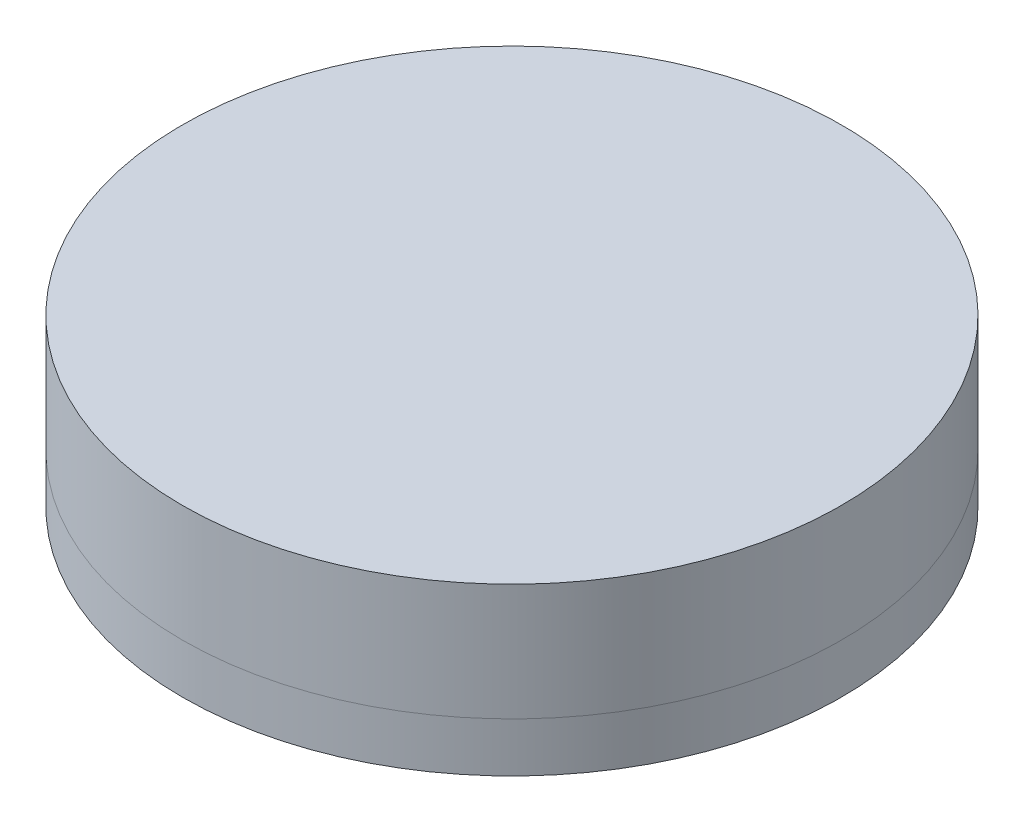
ISO-10303-21;
HEADER;
FILE_DESCRIPTION(('STEP AP214'),'2;1');
FILE_NAME('part.step','',(''),(''),'','','');
FILE_SCHEMA(('AUTOMOTIVE_DESIGN { 1 0 10303 214 1 1 1 1 }'));
ENDSEC;
DATA;
#1=APPLICATION_CONTEXT('core data for automotive mechanical design processes');
#2=APPLICATION_PROTOCOL_DEFINITION('international standard','automotive_design',2000,#1);
#3=PRODUCT_CONTEXT('',#1,'mechanical');
#4=PRODUCT('Part','Part','',(#3));
#5=PRODUCT_RELATED_PRODUCT_CATEGORY('part','',(#4));
#6=PRODUCT_DEFINITION_FORMATION('','',#4);
#7=PRODUCT_DEFINITION_CONTEXT('part definition',#1,'design');
#8=PRODUCT_DEFINITION('design','',#6,#7);
#9=PRODUCT_DEFINITION_SHAPE('','',#8);
#10=(LENGTH_UNIT() NAMED_UNIT(*) SI_UNIT(.MILLI.,.METRE.));
#11=(NAMED_UNIT(*) PLANE_ANGLE_UNIT() SI_UNIT($,.RADIAN.));
#12=(NAMED_UNIT(*) SI_UNIT($,.STERADIAN.) SOLID_ANGLE_UNIT());
#13=UNCERTAINTY_MEASURE_WITH_UNIT(LENGTH_MEASURE(1.E-05),#10,'distance_accuracy_value','');
#14=(GEOMETRIC_REPRESENTATION_CONTEXT(3) GLOBAL_UNCERTAINTY_ASSIGNED_CONTEXT((#13)) GLOBAL_UNIT_ASSIGNED_CONTEXT((#10,
#11,#12)) REPRESENTATION_CONTEXT('',''));
#15=CARTESIAN_POINT('',(0.,0.,0.));
#16=DIRECTION('',(0.,0.,1.));
#17=DIRECTION('',(1.,0.,0.));
#18=AXIS2_PLACEMENT_3D('',#15,#16,#17);
#19=CARTESIAN_POINT('',(0.,-10.125,0.));
#20=DIRECTION('',(0.,1.,0.));
#21=DIRECTION('',(0.,0.,1.));
#22=AXIS2_PLACEMENT_3D('',#19,#20,#21);
#23=DEGENERATE_TOROIDAL_SURFACE('',#22,0.124999999999995,10.125,.F.);
#24=CARTESIAN_POINT('',(0.,-0.0211683331831237,0.));
#25=DIRECTION('',(0.,1.,0.));
#26=DIRECTION('',(0.,0.,1.));
#27=AXIS2_PLACEMENT_3D('',#24,#25,#26);
#28=CIRCLE('',#27,0.52937806245969);
#29=CARTESIAN_POINT('',(0.,-0.0211683331831237,0.52937806245969));
#30=VERTEX_POINT('',#29);
#31=EDGE_CURVE('E67',#30,#30,#28,.T.);
#32=ORIENTED_EDGE('',*,*,#31,.T.);
#33=EDGE_LOOP('',(#32));
#34=FACE_BOUND('',#33,.T.);
#35=CARTESIAN_POINT('',(0.,-1.5,0.));
#36=DIRECTION('',(0.,1.,0.));
#37=DIRECTION('',(0.,0.,1.));
#38=AXIS2_PLACEMENT_3D('',#35,#36,#37);
#39=CIRCLE('',#38,5.17830085889911);
#40=CARTESIAN_POINT('',(0.,-1.5,5.17830085889911));
#41=VERTEX_POINT('',#40);
#42=EDGE_CURVE('E11',#41,#41,#39,.T.);
#43=ORIENTED_EDGE('',*,*,#42,.F.);
#44=EDGE_LOOP('',(#43));
#45=FACE_BOUND('',#44,.T.);
#46=ADVANCED_FACE('F48',(#34,#45),#23,.T.);
#47=CARTESIAN_POINT('',(0.,-1.5,0.));
#48=DIRECTION('',(0.,1.,0.));
#49=DIRECTION('',(0.,0.,1.));
#50=AXIS2_PLACEMENT_3D('',#47,#48,#49);
#51=PLANE('',#50);
#52=CARTESIAN_POINT('',(0.,-1.5,0.));
#53=DIRECTION('',(0.,1.,0.));
#54=DIRECTION('',(0.,0.,1.));
#55=AXIS2_PLACEMENT_3D('',#52,#53,#54);
#56=CIRCLE('',#55,10.);
#57=CARTESIAN_POINT('',(0.,-1.5,10.));
#58=VERTEX_POINT('',#57);
#59=EDGE_CURVE('E54',#58,#58,#56,.T.);
#60=ORIENTED_EDGE('',*,*,#59,.F.);
#61=EDGE_LOOP('',(#60));
#62=FACE_BOUND('',#61,.T.);
#63=ORIENTED_EDGE('',*,*,#42,.T.);
#64=EDGE_LOOP('',(#63));
#65=FACE_BOUND('',#64,.T.);
#66=ADVANCED_FACE('F87',(#62,#65),#51,.F.);
#67=CARTESIAN_POINT('',(0.,3.31412978345045,0.));
#68=DIRECTION('',(0.,1.,0.));
#69=DIRECTION('',(0.,0.,1.));
#70=AXIS2_PLACEMENT_3D('',#67,#68,#69);
#71=CYLINDRICAL_SURFACE('',#70,10.);
#72=ORIENTED_EDGE('',*,*,#59,.T.);
#73=EDGE_LOOP('',(#72));
#74=FACE_BOUND('',#73,.T.);
#75=CARTESIAN_POINT('',(0.,0.,0.));
#76=DIRECTION('',(0.,1.,0.));
#77=DIRECTION('',(0.,0.,1.));
#78=AXIS2_PLACEMENT_3D('',#75,#76,#77);
#79=CIRCLE('',#78,10.);
#80=CARTESIAN_POINT('',(0.,0.,10.));
#81=VERTEX_POINT('',#80);
#82=EDGE_CURVE('E58',#81,#81,#79,.T.);
#83=ORIENTED_EDGE('',*,*,#82,.F.);
#84=EDGE_LOOP('',(#83));
#85=FACE_BOUND('',#84,.T.);
#86=ADVANCED_FACE('F82',(#74,#85),#71,.T.);
#87=CARTESIAN_POINT('',(0.,0.,0.));
#88=DIRECTION('',(0.,-1.,0.));
#89=DIRECTION('',(0.,0.,-1.));
#90=AXIS2_PLACEMENT_3D('',#87,#88,#89);
#91=PLANE('',#90);
#92=CARTESIAN_POINT('',(0.,0.,0.));
#93=DIRECTION('',(0.,1.,0.));
#94=DIRECTION('',(0.,0.,1.));
#95=AXIS2_PLACEMENT_3D('',#92,#93,#94);
#96=CIRCLE('',#95,0.52937806245969);
#97=CARTESIAN_POINT('',(0.,0.,0.52937806245969));
#98=VERTEX_POINT('',#97);
#99=EDGE_CURVE('E62',#98,#98,#96,.T.);
#100=ORIENTED_EDGE('',*,*,#99,.F.);
#101=EDGE_LOOP('',(#100));
#102=FACE_BOUND('',#101,.T.);
#103=ORIENTED_EDGE('',*,*,#82,.T.);
#104=EDGE_LOOP('',(#103));
#105=FACE_BOUND('',#104,.T.);
#106=ADVANCED_FACE('F76',(#102,#105),#91,.F.);
#107=CARTESIAN_POINT('',(0.,3.31412978345045,0.));
#108=DIRECTION('',(0.,1.,0.));
#109=DIRECTION('',(0.,0.,1.));
#110=AXIS2_PLACEMENT_3D('',#107,#108,#109);
#111=CYLINDRICAL_SURFACE('',#110,0.52937806245969);
#112=ORIENTED_EDGE('',*,*,#31,.F.);
#113=EDGE_LOOP('',(#112));
#114=FACE_BOUND('',#113,.T.);
#115=ORIENTED_EDGE('',*,*,#99,.T.);
#116=EDGE_LOOP('',(#115));
#117=FACE_BOUND('',#116,.T.);
#118=ADVANCED_FACE('F73',(#114,#117),#111,.F.);
#119=CLOSED_SHELL('',(#46,#66,#86,#106,#118));
#120=MANIFOLD_SOLID_BREP('B2',#119);
#121=CARTESIAN_POINT('',(0.,3.54,0.));
#122=DIRECTION('',(0.,-1.,0.));
#123=DIRECTION('',(0.,0.,-1.));
#124=AXIS2_PLACEMENT_3D('',#121,#122,#123);
#125=CYLINDRICAL_SURFACE('',#124,10.);
#126=CARTESIAN_POINT('',(0.,3.54,0.));
#127=DIRECTION('',(0.,1.,0.));
#128=DIRECTION('',(0.,0.,1.));
#129=AXIS2_PLACEMENT_3D('',#126,#127,#128);
#130=CIRCLE('',#129,10.);
#131=CARTESIAN_POINT('',(0.,3.54,10.));
#132=VERTEX_POINT('',#131);
#133=EDGE_CURVE('E47',#132,#132,#130,.T.);
#134=ORIENTED_EDGE('',*,*,#133,.F.);
#135=EDGE_LOOP('',(#134));
#136=FACE_BOUND('',#135,.T.);
#137=CARTESIAN_POINT('',(0.,0.,0.));
#138=DIRECTION('',(0.,1.,0.));
#139=DIRECTION('',(0.,0.,1.));
#140=AXIS2_PLACEMENT_3D('',#137,#138,#139);
#141=CIRCLE('',#140,10.);
#142=CARTESIAN_POINT('',(0.,0.,10.));
#143=VERTEX_POINT('',#142);
#144=EDGE_CURVE('E136',#143,#143,#141,.T.);
#145=ORIENTED_EDGE('',*,*,#144,.T.);
#146=EDGE_LOOP('',(#145));
#147=FACE_BOUND('',#146,.T.);
#148=ADVANCED_FACE('F133',(#136,#147),#125,.T.);
#149=CARTESIAN_POINT('',(0.,3.54,0.));
#150=DIRECTION('',(0.,1.,0.));
#151=DIRECTION('',(0.,0.,1.));
#152=AXIS2_PLACEMENT_3D('',#149,#150,#151);
#153=PLANE('',#152);
#154=ORIENTED_EDGE('',*,*,#133,.T.);
#155=EDGE_LOOP('',(#154));
#156=FACE_BOUND('',#155,.T.);
#157=ADVANCED_FACE('F148',(#156),#153,.T.);
#158=CARTESIAN_POINT('',(0.,0.,0.));
#159=DIRECTION('',(0.,1.,0.));
#160=DIRECTION('',(0.,0.,1.));
#161=AXIS2_PLACEMENT_3D('',#158,#159,#160);
#162=PLANE('',#161);
#163=ORIENTED_EDGE('',*,*,#144,.F.);
#164=EDGE_LOOP('',(#163));
#165=FACE_BOUND('',#164,.T.);
#166=ADVANCED_FACE('F146',(#165),#162,.F.);
#167=CLOSED_SHELL('',(#148,#157,#166));
#168=MANIFOLD_SOLID_BREP('B6',#167);
#169=ADVANCED_BREP_SHAPE_REPRESENTATION('',(#18,#120,#168),#14);
#170=SHAPE_DEFINITION_REPRESENTATION(#9,#169);
ENDSEC;
END-ISO-10303-21;
